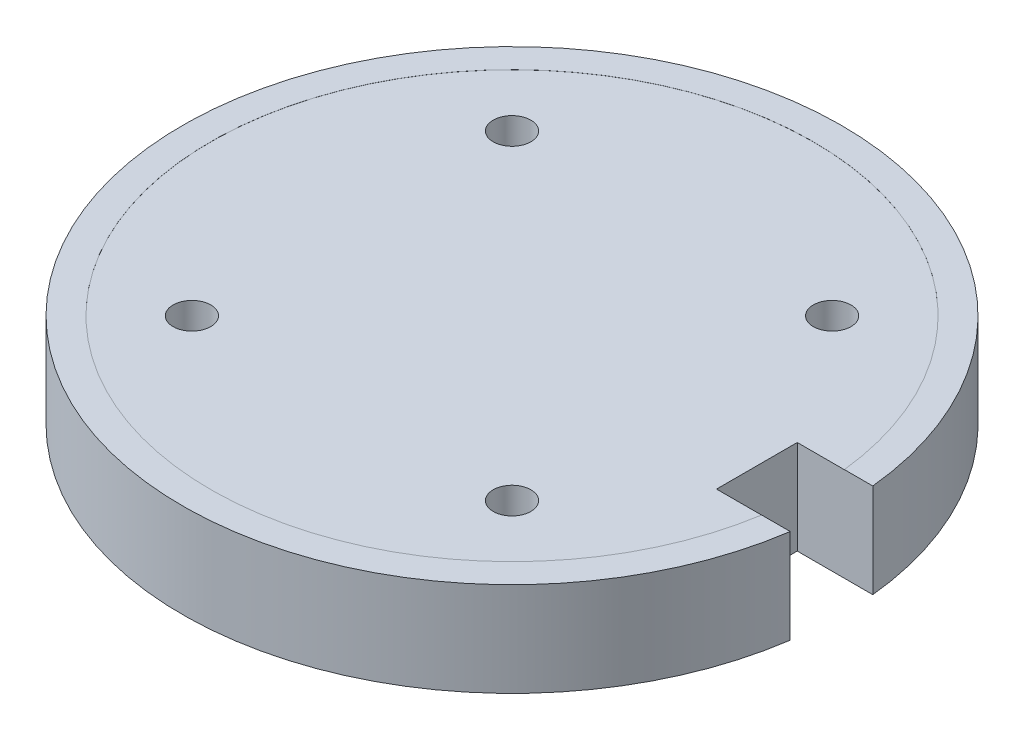
ISO-10303-21;
HEADER;
FILE_DESCRIPTION(('STEP AP214'),'2;1');
FILE_NAME('part.step','',(''),(''),'','','');
FILE_SCHEMA(('AUTOMOTIVE_DESIGN { 1 0 10303 214 1 1 1 1 }'));
ENDSEC;
DATA;
#1=APPLICATION_CONTEXT('core data for automotive mechanical design processes');
#2=APPLICATION_PROTOCOL_DEFINITION('international standard','automotive_design',2000,#1);
#3=PRODUCT_CONTEXT('',#1,'mechanical');
#4=PRODUCT('Part','Part','',(#3));
#5=PRODUCT_RELATED_PRODUCT_CATEGORY('part','',(#4));
#6=PRODUCT_DEFINITION_FORMATION('','',#4);
#7=PRODUCT_DEFINITION_CONTEXT('part definition',#1,'design');
#8=PRODUCT_DEFINITION('design','',#6,#7);
#9=PRODUCT_DEFINITION_SHAPE('','',#8);
#10=(LENGTH_UNIT() NAMED_UNIT(*) SI_UNIT(.MILLI.,.METRE.));
#11=(NAMED_UNIT(*) PLANE_ANGLE_UNIT() SI_UNIT($,.RADIAN.));
#12=(NAMED_UNIT(*) SI_UNIT($,.STERADIAN.) SOLID_ANGLE_UNIT());
#13=UNCERTAINTY_MEASURE_WITH_UNIT(LENGTH_MEASURE(1.E-05),#10,'distance_accuracy_value','');
#14=(GEOMETRIC_REPRESENTATION_CONTEXT(3) GLOBAL_UNCERTAINTY_ASSIGNED_CONTEXT((#13)) GLOBAL_UNIT_ASSIGNED_CONTEXT((#10,
#11,#12)) REPRESENTATION_CONTEXT('',''));
#15=CARTESIAN_POINT('',(0.,0.,0.));
#16=DIRECTION('',(0.,0.,1.));
#17=DIRECTION('',(1.,0.,0.));
#18=AXIS2_PLACEMENT_3D('',#15,#16,#17);
#19=CARTESIAN_POINT('',(26.8023269621628,0.,-3.49209607444166));
#20=DIRECTION('',(-1.,0.,0.));
#21=DIRECTION('',(0.,0.,1.));
#22=AXIS2_PLACEMENT_3D('',#19,#20,#21);
#23=PLANE('',#22);
#24=DIRECTION('',(0.,0.,-1.));
#25=VECTOR('',#24,1.);
#26=CARTESIAN_POINT('',(26.8023269621628,9.99,-3.49209607444166));
#27=LINE('',#26,#25);
#28=CARTESIAN_POINT('',(26.8023269621628,9.99,5.08084170476093));
#29=VERTEX_POINT('',#28);
#30=CARTESIAN_POINT('',(26.8023269621628,9.99,-3.49209607444166));
#31=VERTEX_POINT('',#30);
#32=EDGE_CURVE('E146',#29,#31,#27,.T.);
#33=ORIENTED_EDGE('',*,*,#32,.F.);
#34=DIRECTION('',(0.,1.,0.));
#35=VECTOR('',#34,1.);
#36=CARTESIAN_POINT('',(26.8023269621628,0.,5.08084170476093));
#37=LINE('',#36,#35);
#38=CARTESIAN_POINT('',(26.8023269621628,0.,5.08084170476093));
#39=VERTEX_POINT('',#38);
#40=EDGE_CURVE('E120',#39,#29,#37,.T.);
#41=ORIENTED_EDGE('',*,*,#40,.F.);
#42=DIRECTION('',(0.,0.,1.));
#43=VECTOR('',#42,1.);
#44=CARTESIAN_POINT('',(26.8023269621628,0.,-3.49209607444166));
#45=LINE('',#44,#43);
#46=CARTESIAN_POINT('',(26.8023269621628,0.,-3.49209607444166));
#47=VERTEX_POINT('',#46);
#48=EDGE_CURVE('E108',#47,#39,#45,.T.);
#49=ORIENTED_EDGE('',*,*,#48,.F.);
#50=DIRECTION('',(0.,1.,0.));
#51=VECTOR('',#50,1.);
#52=CARTESIAN_POINT('',(26.8023269621628,0.,-3.49209607444166));
#53=LINE('',#52,#51);
#54=EDGE_CURVE('E117',#47,#31,#53,.T.);
#55=ORIENTED_EDGE('',*,*,#54,.T.);
#56=EDGE_LOOP('',(#33,#41,#49,#55));
#57=FACE_BOUND('',#56,.T.);
#58=ADVANCED_FACE('F33',(#57),#23,.F.);
#59=CARTESIAN_POINT('',(-17.,0.,-17.));
#60=DIRECTION('',(0.,1.,0.));
#61=DIRECTION('',(0.,0.,1.));
#62=AXIS2_PLACEMENT_3D('',#59,#60,#61);
#63=CYLINDRICAL_SURFACE('',#62,2.);
#64=CARTESIAN_POINT('',(-17.,0.,-17.));
#65=DIRECTION('',(0.,1.,0.));
#66=DIRECTION('',(0.,0.,1.));
#67=AXIS2_PLACEMENT_3D('',#64,#65,#66);
#68=CIRCLE('',#67,2.);
#69=CARTESIAN_POINT('',(-17.,0.,-15.));
#70=VERTEX_POINT('',#69);
#71=EDGE_CURVE('E106',#70,#70,#68,.T.);
#72=ORIENTED_EDGE('',*,*,#71,.F.);
#73=EDGE_LOOP('',(#72));
#74=FACE_BOUND('',#73,.T.);
#75=CARTESIAN_POINT('',(-17.,9.99,-17.));
#76=DIRECTION('',(0.,1.,0.));
#77=DIRECTION('',(0.,0.,1.));
#78=AXIS2_PLACEMENT_3D('',#75,#76,#77);
#79=CIRCLE('',#78,2.);
#80=CARTESIAN_POINT('',(-17.,9.99,-15.));
#81=VERTEX_POINT('',#80);
#82=EDGE_CURVE('E143',#81,#81,#79,.F.);
#83=ORIENTED_EDGE('',*,*,#82,.F.);
#84=EDGE_LOOP('',(#83));
#85=FACE_BOUND('',#84,.T.);
#86=ADVANCED_FACE('F179',(#74,#85),#63,.F.);
#87=CARTESIAN_POINT('',(17.,10.,-17.));
#88=DIRECTION('',(0.,-1.,0.));
#89=DIRECTION('',(0.,0.,-1.));
#90=AXIS2_PLACEMENT_3D('',#87,#88,#89);
#91=CYLINDRICAL_SURFACE('',#90,2.);
#92=CARTESIAN_POINT('',(17.,0.,-17.));
#93=DIRECTION('',(0.,-1.,0.));
#94=DIRECTION('',(0.,0.,-1.));
#95=AXIS2_PLACEMENT_3D('',#92,#93,#94);
#96=CIRCLE('',#95,2.);
#97=CARTESIAN_POINT('',(17.,0.,-19.));
#98=VERTEX_POINT('',#97);
#99=EDGE_CURVE('E111',#98,#98,#96,.T.);
#100=ORIENTED_EDGE('',*,*,#99,.T.);
#101=EDGE_LOOP('',(#100));
#102=FACE_BOUND('',#101,.T.);
#103=CARTESIAN_POINT('',(17.,9.99,-17.));
#104=DIRECTION('',(0.,1.,0.));
#105=DIRECTION('',(0.,0.,1.));
#106=AXIS2_PLACEMENT_3D('',#103,#104,#105);
#107=CIRCLE('',#106,2.);
#108=CARTESIAN_POINT('',(17.,9.99,-15.));
#109=VERTEX_POINT('',#108);
#110=EDGE_CURVE('E137',#109,#109,#107,.F.);
#111=ORIENTED_EDGE('',*,*,#110,.F.);
#112=EDGE_LOOP('',(#111));
#113=FACE_BOUND('',#112,.T.);
#114=ADVANCED_FACE('F184',(#102,#113),#91,.F.);
#115=CARTESIAN_POINT('',(-17.,10.,17.));
#116=DIRECTION('',(0.,-1.,0.));
#117=DIRECTION('',(0.,0.,-1.));
#118=AXIS2_PLACEMENT_3D('',#115,#116,#117);
#119=CYLINDRICAL_SURFACE('',#118,2.);
#120=CARTESIAN_POINT('',(-17.,0.,17.));
#121=DIRECTION('',(0.,-1.,0.));
#122=DIRECTION('',(0.,0.,-1.));
#123=AXIS2_PLACEMENT_3D('',#120,#121,#122);
#124=CIRCLE('',#123,2.);
#125=CARTESIAN_POINT('',(-17.,0.,15.));
#126=VERTEX_POINT('',#125);
#127=EDGE_CURVE('E155',#126,#126,#124,.T.);
#128=ORIENTED_EDGE('',*,*,#127,.T.);
#129=EDGE_LOOP('',(#128));
#130=FACE_BOUND('',#129,.T.);
#131=CARTESIAN_POINT('',(-17.,9.99,17.));
#132=DIRECTION('',(0.,1.,0.));
#133=DIRECTION('',(0.,0.,1.));
#134=AXIS2_PLACEMENT_3D('',#131,#132,#133);
#135=CIRCLE('',#134,2.);
#136=CARTESIAN_POINT('',(-17.,9.99,19.));
#137=VERTEX_POINT('',#136);
#138=EDGE_CURVE('E133',#137,#137,#135,.F.);
#139=ORIENTED_EDGE('',*,*,#138,.F.);
#140=EDGE_LOOP('',(#139));
#141=FACE_BOUND('',#140,.T.);
#142=ADVANCED_FACE('F208',(#130,#141),#119,.F.);
#143=CARTESIAN_POINT('',(17.,10.,17.));
#144=DIRECTION('',(0.,-1.,0.));
#145=DIRECTION('',(0.,0.,-1.));
#146=AXIS2_PLACEMENT_3D('',#143,#144,#145);
#147=CYLINDRICAL_SURFACE('',#146,2.);
#148=CARTESIAN_POINT('',(17.,0.,17.));
#149=DIRECTION('',(0.,-1.,0.));
#150=DIRECTION('',(0.,0.,-1.));
#151=AXIS2_PLACEMENT_3D('',#148,#149,#150);
#152=CIRCLE('',#151,2.);
#153=CARTESIAN_POINT('',(17.,0.,15.));
#154=VERTEX_POINT('',#153);
#155=EDGE_CURVE('E152',#154,#154,#152,.T.);
#156=ORIENTED_EDGE('',*,*,#155,.T.);
#157=EDGE_LOOP('',(#156));
#158=FACE_BOUND('',#157,.T.);
#159=CARTESIAN_POINT('',(17.,9.99,17.));
#160=DIRECTION('',(0.,1.,0.));
#161=DIRECTION('',(0.,0.,1.));
#162=AXIS2_PLACEMENT_3D('',#159,#160,#161);
#163=CIRCLE('',#162,2.);
#164=CARTESIAN_POINT('',(17.,9.99,19.));
#165=VERTEX_POINT('',#164);
#166=EDGE_CURVE('E131',#165,#165,#163,.F.);
#167=ORIENTED_EDGE('',*,*,#166,.F.);
#168=EDGE_LOOP('',(#167));
#169=FACE_BOUND('',#168,.T.);
#170=ADVANCED_FACE('F215',(#158,#169),#147,.F.);
#171=CARTESIAN_POINT('',(0.,10.,0.));
#172=DIRECTION('',(0.,-1.,0.));
#173=DIRECTION('',(0.,0.,-1.));
#174=AXIS2_PLACEMENT_3D('',#171,#172,#173);
#175=CYLINDRICAL_SURFACE('',#174,35.);
#176=CARTESIAN_POINT('',(0.,10.,0.));
#177=DIRECTION('',(0.,1.,0.));
#178=DIRECTION('',(0.,0.,1.));
#179=AXIS2_PLACEMENT_3D('',#176,#177,#178);
#180=CIRCLE('',#179,35.);
#181=CARTESIAN_POINT('',(34.825353767146,10.,-3.49209607444166));
#182=VERTEX_POINT('',#181);
#183=CARTESIAN_POINT('',(34.6292513284819,10.,5.08084170476093));
#184=VERTEX_POINT('',#183);
#185=EDGE_CURVE('E104',#182,#184,#180,.T.);
#186=ORIENTED_EDGE('',*,*,#185,.F.);
#187=DIRECTION('',(0.,-1.,0.));
#188=VECTOR('',#187,1.);
#189=CARTESIAN_POINT('',(34.825353767146,10.,-3.49209607444166));
#190=LINE('',#189,#188);
#191=CARTESIAN_POINT('',(34.825353767146,0.,-3.49209607444166));
#192=VERTEX_POINT('',#191);
#193=EDGE_CURVE('E123',#182,#192,#190,.T.);
#194=ORIENTED_EDGE('',*,*,#193,.T.);
#195=CARTESIAN_POINT('',(0.,0.,0.));
#196=DIRECTION('',(0.,1.,0.));
#197=DIRECTION('',(0.,0.,1.));
#198=AXIS2_PLACEMENT_3D('',#195,#196,#197);
#199=CIRCLE('',#198,35.);
#200=CARTESIAN_POINT('',(34.6292513284819,0.,5.08084170476093));
#201=VERTEX_POINT('',#200);
#202=EDGE_CURVE('E126',#192,#201,#199,.T.);
#203=ORIENTED_EDGE('',*,*,#202,.T.);
#204=DIRECTION('',(0.,-1.,0.));
#205=VECTOR('',#204,1.);
#206=CARTESIAN_POINT('',(34.6292513284819,10.,5.08084170476093));
#207=LINE('',#206,#205);
#208=EDGE_CURVE('E56',#201,#184,#207,.F.);
#209=ORIENTED_EDGE('',*,*,#208,.T.);
#210=EDGE_LOOP('',(#186,#194,#203,#209));
#211=FACE_BOUND('',#210,.T.);
#212=ADVANCED_FACE('F35',(#211),#175,.T.);
#213=CARTESIAN_POINT('',(0.,10.,0.));
#214=DIRECTION('',(0.,1.,0.));
#215=DIRECTION('',(0.,0.,1.));
#216=AXIS2_PLACEMENT_3D('',#213,#214,#215);
#217=PLANE('',#216);
#218=CARTESIAN_POINT('',(0.,10.,0.));
#219=DIRECTION('',(0.,1.,0.));
#220=DIRECTION('',(0.,0.,1.));
#221=AXIS2_PLACEMENT_3D('',#218,#219,#220);
#222=CIRCLE('',#221,32.);
#223=CARTESIAN_POINT('',(31.8088865728882,10.,-3.49209607444166));
#224=VERTEX_POINT('',#223);
#225=CARTESIAN_POINT('',(31.5940666513692,10.,5.08084170476093));
#226=VERTEX_POINT('',#225);
#227=EDGE_CURVE('E87',#224,#226,#222,.T.);
#228=ORIENTED_EDGE('',*,*,#227,.F.);
#229=DIRECTION('',(-1.,0.,0.));
#230=VECTOR('',#229,1.);
#231=CARTESIAN_POINT('',(35.2527942016625,10.,-3.49209607444166));
#232=LINE('',#231,#230);
#233=EDGE_CURVE('E105',#182,#224,#232,.T.);
#234=ORIENTED_EDGE('',*,*,#233,.F.);
#235=ORIENTED_EDGE('',*,*,#185,.T.);
#236=DIRECTION('',(1.,0.,0.));
#237=VECTOR('',#236,1.);
#238=CARTESIAN_POINT('',(35.2527942016625,10.,5.08084170476093));
#239=LINE('',#238,#237);
#240=EDGE_CURVE('E99',#226,#184,#239,.T.);
#241=ORIENTED_EDGE('',*,*,#240,.F.);
#242=EDGE_LOOP('',(#228,#234,#235,#241));
#243=FACE_BOUND('',#242,.T.);
#244=ADVANCED_FACE('F102',(#243),#217,.T.);
#245=CARTESIAN_POINT('',(0.,0.,0.));
#246=DIRECTION('',(0.,1.,0.));
#247=DIRECTION('',(0.,0.,1.));
#248=AXIS2_PLACEMENT_3D('',#245,#246,#247);
#249=PLANE('',#248);
#250=ORIENTED_EDGE('',*,*,#155,.F.);
#251=EDGE_LOOP('',(#250));
#252=FACE_BOUND('',#251,.T.);
#253=ORIENTED_EDGE('',*,*,#127,.F.);
#254=EDGE_LOOP('',(#253));
#255=FACE_BOUND('',#254,.T.);
#256=ORIENTED_EDGE('',*,*,#99,.F.);
#257=EDGE_LOOP('',(#256));
#258=FACE_BOUND('',#257,.T.);
#259=ORIENTED_EDGE('',*,*,#71,.T.);
#260=EDGE_LOOP('',(#259));
#261=FACE_BOUND('',#260,.T.);
#262=ORIENTED_EDGE('',*,*,#202,.F.);
#263=DIRECTION('',(-1.,0.,0.));
#264=VECTOR('',#263,1.);
#265=CARTESIAN_POINT('',(0.,0.,-3.49209607444166));
#266=LINE('',#265,#264);
#267=EDGE_CURVE('E41',#192,#47,#266,.T.);
#268=ORIENTED_EDGE('',*,*,#267,.T.);
#269=ORIENTED_EDGE('',*,*,#48,.T.);
#270=DIRECTION('',(1.,0.,0.));
#271=VECTOR('',#270,1.);
#272=CARTESIAN_POINT('',(35.2527942016625,0.,5.08084170476093));
#273=LINE('',#272,#271);
#274=EDGE_CURVE('E114',#39,#201,#273,.T.);
#275=ORIENTED_EDGE('',*,*,#274,.T.);
#276=EDGE_LOOP('',(#262,#268,#269,#275));
#277=FACE_BOUND('',#276,.T.);
#278=ADVANCED_FACE('F163',(#252,#255,#258,#261,#277),#249,.F.);
#279=CARTESIAN_POINT('',(35.2527942016625,0.,-3.49209607444166));
#280=DIRECTION('',(0.,0.,-1.));
#281=DIRECTION('',(-1.,0.,0.));
#282=AXIS2_PLACEMENT_3D('',#279,#280,#281);
#283=PLANE('',#282);
#284=ORIENTED_EDGE('',*,*,#233,.T.);
#285=DIRECTION('',(0.,1.,0.));
#286=VECTOR('',#285,1.);
#287=CARTESIAN_POINT('',(31.8088865728882,9.99,-3.49209607444166));
#288=LINE('',#287,#286);
#289=CARTESIAN_POINT('',(31.8088865728882,9.99,-3.49209607444166));
#290=VERTEX_POINT('',#289);
#291=EDGE_CURVE('E91',#224,#290,#288,.F.);
#292=ORIENTED_EDGE('',*,*,#291,.T.);
#293=DIRECTION('',(1.,0.,0.));
#294=VECTOR('',#293,1.);
#295=CARTESIAN_POINT('',(35.2527942016625,9.99,-3.49209607444166));
#296=LINE('',#295,#294);
#297=EDGE_CURVE('E149',#31,#290,#296,.T.);
#298=ORIENTED_EDGE('',*,*,#297,.F.);
#299=ORIENTED_EDGE('',*,*,#54,.F.);
#300=ORIENTED_EDGE('',*,*,#267,.F.);
#301=ORIENTED_EDGE('',*,*,#193,.F.);
#302=EDGE_LOOP('',(#284,#292,#298,#299,#300,#301));
#303=FACE_BOUND('',#302,.T.);
#304=ADVANCED_FACE('F166',(#303),#283,.F.);
#305=CARTESIAN_POINT('',(35.2527942016625,0.,5.08084170476093));
#306=DIRECTION('',(0.,0.,1.));
#307=DIRECTION('',(1.,0.,0.));
#308=AXIS2_PLACEMENT_3D('',#305,#306,#307);
#309=PLANE('',#308);
#310=DIRECTION('',(-1.,0.,0.));
#311=VECTOR('',#310,1.);
#312=CARTESIAN_POINT('',(35.2527942016625,9.99,5.08084170476093));
#313=LINE('',#312,#311);
#314=CARTESIAN_POINT('',(31.5940666513692,9.99,5.08084170476093));
#315=VERTEX_POINT('',#314);
#316=EDGE_CURVE('E48',#315,#29,#313,.T.);
#317=ORIENTED_EDGE('',*,*,#316,.F.);
#318=DIRECTION('',(0.,1.,0.));
#319=VECTOR('',#318,1.);
#320=CARTESIAN_POINT('',(31.5940666513692,9.99,5.08084170476093));
#321=LINE('',#320,#319);
#322=EDGE_CURVE('E11',#315,#226,#321,.T.);
#323=ORIENTED_EDGE('',*,*,#322,.T.);
#324=ORIENTED_EDGE('',*,*,#240,.T.);
#325=ORIENTED_EDGE('',*,*,#208,.F.);
#326=ORIENTED_EDGE('',*,*,#274,.F.);
#327=ORIENTED_EDGE('',*,*,#40,.T.);
#328=EDGE_LOOP('',(#317,#323,#324,#325,#326,#327));
#329=FACE_BOUND('',#328,.T.);
#330=ADVANCED_FACE('F98',(#329),#309,.F.);
#331=CARTESIAN_POINT('',(0.,9.99,0.));
#332=DIRECTION('',(0.,1.,0.));
#333=DIRECTION('',(0.,0.,1.));
#334=AXIS2_PLACEMENT_3D('',#331,#332,#333);
#335=CYLINDRICAL_SURFACE('',#334,32.);
#336=ORIENTED_EDGE('',*,*,#227,.T.);
#337=ORIENTED_EDGE('',*,*,#322,.F.);
#338=CARTESIAN_POINT('',(0.,9.99,0.));
#339=DIRECTION('',(0.,1.,0.));
#340=DIRECTION('',(0.,0.,1.));
#341=AXIS2_PLACEMENT_3D('',#338,#339,#340);
#342=CIRCLE('',#341,32.);
#343=EDGE_CURVE('E96',#290,#315,#342,.T.);
#344=ORIENTED_EDGE('',*,*,#343,.F.);
#345=ORIENTED_EDGE('',*,*,#291,.F.);
#346=EDGE_LOOP('',(#336,#337,#344,#345));
#347=FACE_BOUND('',#346,.T.);
#348=ADVANCED_FACE('F88',(#347),#335,.F.);
#349=CARTESIAN_POINT('',(0.,9.99,0.));
#350=DIRECTION('',(0.,1.,0.));
#351=DIRECTION('',(0.,0.,1.));
#352=AXIS2_PLACEMENT_3D('',#349,#350,#351);
#353=PLANE('',#352);
#354=ORIENTED_EDGE('',*,*,#82,.T.);
#355=EDGE_LOOP('',(#354));
#356=FACE_BOUND('',#355,.T.);
#357=ORIENTED_EDGE('',*,*,#110,.T.);
#358=EDGE_LOOP('',(#357));
#359=FACE_BOUND('',#358,.T.);
#360=ORIENTED_EDGE('',*,*,#138,.T.);
#361=EDGE_LOOP('',(#360));
#362=FACE_BOUND('',#361,.T.);
#363=ORIENTED_EDGE('',*,*,#166,.T.);
#364=EDGE_LOOP('',(#363));
#365=FACE_BOUND('',#364,.T.);
#366=ORIENTED_EDGE('',*,*,#297,.T.);
#367=ORIENTED_EDGE('',*,*,#343,.T.);
#368=ORIENTED_EDGE('',*,*,#316,.T.);
#369=ORIENTED_EDGE('',*,*,#32,.T.);
#370=EDGE_LOOP('',(#366,#367,#368,#369));
#371=FACE_BOUND('',#370,.T.);
#372=ADVANCED_FACE('F169',(#356,#359,#362,#365,#371),#353,.T.);
#373=CLOSED_SHELL('',(#58,#86,#114,#142,#170,#212,#244,#278,#304,#330,#348,#372));
#374=MANIFOLD_SOLID_BREP('B2',#373);
#375=ADVANCED_BREP_SHAPE_REPRESENTATION('',(#18,#374),#14);
#376=SHAPE_DEFINITION_REPRESENTATION(#9,#375);
ENDSEC;
END-ISO-10303-21;
